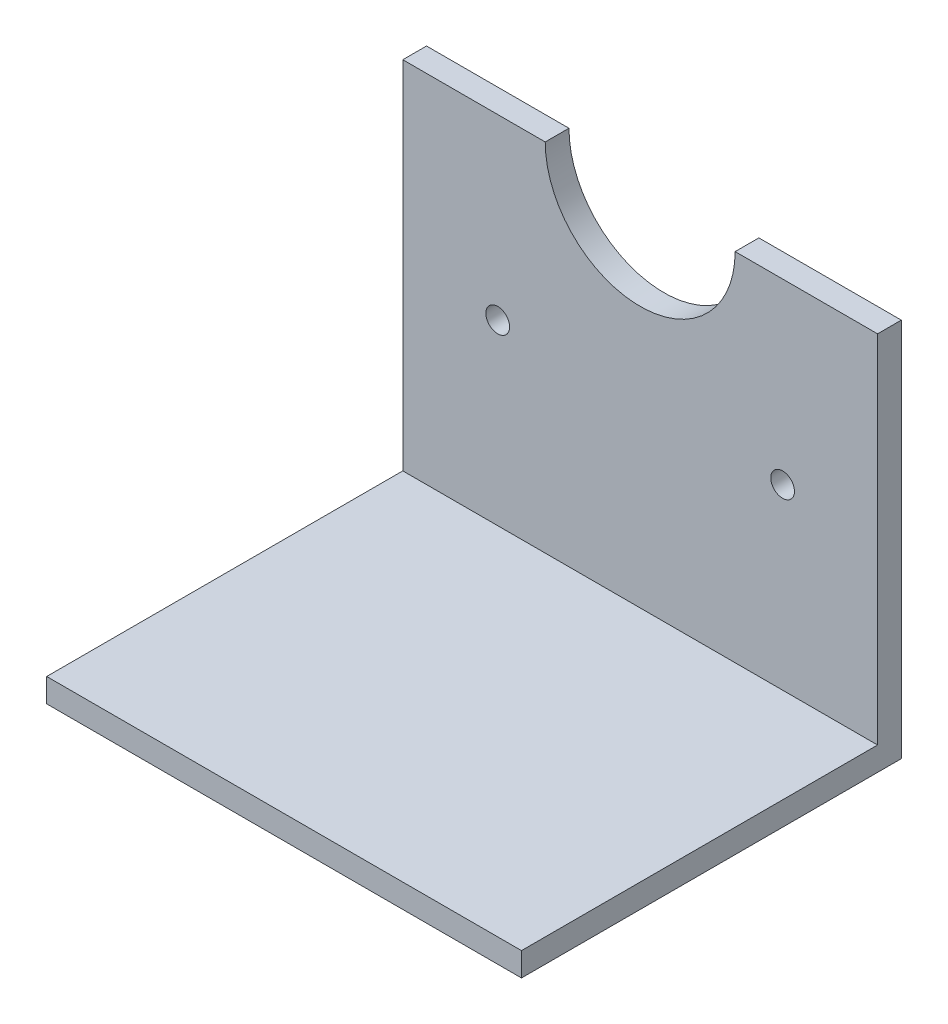
ISO-10303-21;
HEADER;
FILE_DESCRIPTION(('STEP AP214'),'2;1');
FILE_NAME('part.step','',(''),(''),'','','');
FILE_SCHEMA(('AUTOMOTIVE_DESIGN { 1 0 10303 214 1 1 1 1 }'));
ENDSEC;
DATA;
#1=APPLICATION_CONTEXT('core data for automotive mechanical design processes');
#2=APPLICATION_PROTOCOL_DEFINITION('international standard','automotive_design',2000,#1);
#3=PRODUCT_CONTEXT('',#1,'mechanical');
#4=PRODUCT('Part','Part','',(#3));
#5=PRODUCT_RELATED_PRODUCT_CATEGORY('part','',(#4));
#6=PRODUCT_DEFINITION_FORMATION('','',#4);
#7=PRODUCT_DEFINITION_CONTEXT('part definition',#1,'design');
#8=PRODUCT_DEFINITION('design','',#6,#7);
#9=PRODUCT_DEFINITION_SHAPE('','',#8);
#10=(LENGTH_UNIT() NAMED_UNIT(*) SI_UNIT(.MILLI.,.METRE.));
#11=(NAMED_UNIT(*) PLANE_ANGLE_UNIT() SI_UNIT($,.RADIAN.));
#12=(NAMED_UNIT(*) SI_UNIT($,.STERADIAN.) SOLID_ANGLE_UNIT());
#13=UNCERTAINTY_MEASURE_WITH_UNIT(LENGTH_MEASURE(1.E-05),#10,'distance_accuracy_value','');
#14=(GEOMETRIC_REPRESENTATION_CONTEXT(3) GLOBAL_UNCERTAINTY_ASSIGNED_CONTEXT((#13)) GLOBAL_UNIT_ASSIGNED_CONTEXT((#10,
#11,#12)) REPRESENTATION_CONTEXT('',''));
#15=CARTESIAN_POINT('',(0.,0.,0.));
#16=DIRECTION('',(0.,0.,1.));
#17=DIRECTION('',(1.,0.,0.));
#18=AXIS2_PLACEMENT_3D('',#15,#16,#17);
#19=CARTESIAN_POINT('',(63.5,47.625,0.));
#20=DIRECTION('',(0.,-1.,0.));
#21=DIRECTION('',(0.,0.,-1.));
#22=AXIS2_PLACEMENT_3D('',#19,#20,#21);
#23=PLANE('',#22);
#24=DIRECTION('',(-1.,0.,0.));
#25=VECTOR('',#24,1.);
#26=CARTESIAN_POINT('',(63.5,47.625,0.));
#27=LINE('',#26,#25);
#28=CARTESIAN_POINT('',(63.5,47.625,0.));
#29=VERTEX_POINT('',#28);
#30=CARTESIAN_POINT('',(44.45,47.625,0.));
#31=VERTEX_POINT('',#30);
#32=EDGE_CURVE('E11',#29,#31,#27,.T.);
#33=ORIENTED_EDGE('',*,*,#32,.T.);
#34=DIRECTION('',(0.,0.,1.));
#35=VECTOR('',#34,1.);
#36=CARTESIAN_POINT('',(44.45,47.625,-35.9210244842766));
#37=LINE('',#36,#35);
#38=CARTESIAN_POINT('',(44.45,47.625,3.175));
#39=VERTEX_POINT('',#38);
#40=EDGE_CURVE('E47',#31,#39,#37,.T.);
#41=ORIENTED_EDGE('',*,*,#40,.T.);
#42=DIRECTION('',(-1.,0.,0.));
#43=VECTOR('',#42,1.);
#44=CARTESIAN_POINT('',(63.5,47.625,3.175));
#45=LINE('',#44,#43);
#46=CARTESIAN_POINT('',(63.5,47.625,3.175));
#47=VERTEX_POINT('',#46);
#48=EDGE_CURVE('E147',#47,#39,#45,.T.);
#49=ORIENTED_EDGE('',*,*,#48,.F.);
#50=DIRECTION('',(0.,0.,1.));
#51=VECTOR('',#50,1.);
#52=CARTESIAN_POINT('',(63.5,47.625,0.));
#53=LINE('',#52,#51);
#54=EDGE_CURVE('E92',#29,#47,#53,.T.);
#55=ORIENTED_EDGE('',*,*,#54,.F.);
#56=EDGE_LOOP('',(#33,#41,#49,#55));
#57=FACE_BOUND('',#56,.T.);
#58=ADVANCED_FACE('F32',(#57),#23,.F.);
#59=CARTESIAN_POINT('',(19.05,47.625,3.175));
#60=VERTEX_POINT('',#59);
#61=CARTESIAN_POINT('',(0.,47.625,3.175));
#62=VERTEX_POINT('',#61);
#63=EDGE_CURVE('E146',#60,#62,#45,.T.);
#64=ORIENTED_EDGE('',*,*,#63,.F.);
#65=DIRECTION('',(0.,0.,1.));
#66=VECTOR('',#65,1.);
#67=CARTESIAN_POINT('',(19.05,47.625,-35.9210244842766));
#68=LINE('',#67,#66);
#69=CARTESIAN_POINT('',(19.05,47.625,0.));
#70=VERTEX_POINT('',#69);
#71=EDGE_CURVE('E168',#60,#70,#68,.F.);
#72=ORIENTED_EDGE('',*,*,#71,.T.);
#73=CARTESIAN_POINT('',(0.,47.625,0.));
#74=VERTEX_POINT('',#73);
#75=EDGE_CURVE('E40',#70,#74,#27,.T.);
#76=ORIENTED_EDGE('',*,*,#75,.T.);
#77=DIRECTION('',(0.,0.,1.));
#78=VECTOR('',#77,1.);
#79=CARTESIAN_POINT('',(0.,47.625,0.));
#80=LINE('',#79,#78);
#81=EDGE_CURVE('E132',#74,#62,#80,.T.);
#82=ORIENTED_EDGE('',*,*,#81,.T.);
#83=EDGE_LOOP('',(#64,#72,#76,#82));
#84=FACE_BOUND('',#83,.T.);
#85=ADVANCED_FACE('F34',(#84),#23,.F.);
#86=CARTESIAN_POINT('',(63.5,0.,3.175));
#87=DIRECTION('',(0.,0.,-1.));
#88=DIRECTION('',(-1.,0.,0.));
#89=AXIS2_PLACEMENT_3D('',#86,#87,#88);
#90=PLANE('',#89);
#91=CARTESIAN_POINT('',(12.7,23.8125,3.175));
#92=DIRECTION('',(0.,0.,1.));
#93=DIRECTION('',(1.,0.,0.));
#94=AXIS2_PLACEMENT_3D('',#91,#92,#93);
#95=CIRCLE('',#94,1.58749999999998);
#96=CARTESIAN_POINT('',(14.2875,23.8125,3.175));
#97=VERTEX_POINT('',#96);
#98=EDGE_CURVE('E176',#97,#97,#95,.T.);
#99=ORIENTED_EDGE('',*,*,#98,.F.);
#100=EDGE_LOOP('',(#99));
#101=FACE_BOUND('',#100,.T.);
#102=CARTESIAN_POINT('',(50.8,23.8125,3.175));
#103=DIRECTION('',(0.,0.,1.));
#104=DIRECTION('',(1.,0.,0.));
#105=AXIS2_PLACEMENT_3D('',#102,#103,#104);
#106=CIRCLE('',#105,1.58749999999998);
#107=CARTESIAN_POINT('',(52.3875,23.8125,3.175));
#108=VERTEX_POINT('',#107);
#109=EDGE_CURVE('E177',#108,#108,#106,.T.);
#110=ORIENTED_EDGE('',*,*,#109,.F.);
#111=EDGE_LOOP('',(#110));
#112=FACE_BOUND('',#111,.T.);
#113=ORIENTED_EDGE('',*,*,#48,.T.);
#114=CARTESIAN_POINT('',(31.75,47.625,3.175));
#115=DIRECTION('',(0.,0.,1.));
#116=DIRECTION('',(1.,0.,0.));
#117=AXIS2_PLACEMENT_3D('',#114,#115,#116);
#118=CIRCLE('',#117,12.7);
#119=EDGE_CURVE('E155',#60,#39,#118,.T.);
#120=ORIENTED_EDGE('',*,*,#119,.F.);
#121=ORIENTED_EDGE('',*,*,#63,.T.);
#122=DIRECTION('',(0.,-1.,0.));
#123=VECTOR('',#122,1.);
#124=CARTESIAN_POINT('',(0.,0.,3.175));
#125=LINE('',#124,#123);
#126=CARTESIAN_POINT('',(0.,0.,3.175));
#127=VERTEX_POINT('',#126);
#128=EDGE_CURVE('E135',#62,#127,#125,.T.);
#129=ORIENTED_EDGE('',*,*,#128,.T.);
#130=DIRECTION('',(-1.,0.,0.));
#131=VECTOR('',#130,1.);
#132=CARTESIAN_POINT('',(63.5,0.,3.175));
#133=LINE('',#132,#131);
#134=CARTESIAN_POINT('',(63.5,0.,3.175));
#135=VERTEX_POINT('',#134);
#136=EDGE_CURVE('E121',#135,#127,#133,.T.);
#137=ORIENTED_EDGE('',*,*,#136,.F.);
#138=DIRECTION('',(0.,-1.,0.));
#139=VECTOR('',#138,1.);
#140=CARTESIAN_POINT('',(63.5,0.,3.175));
#141=LINE('',#140,#139);
#142=EDGE_CURVE('E109',#47,#135,#141,.T.);
#143=ORIENTED_EDGE('',*,*,#142,.F.);
#144=EDGE_LOOP('',(#113,#120,#121,#129,#137,#143));
#145=FACE_BOUND('',#144,.T.);
#146=ADVANCED_FACE('F153',(#101,#112,#145),#90,.F.);
#147=CARTESIAN_POINT('',(63.5,0.,3.175));
#148=DIRECTION('',(0.,-1.,0.));
#149=DIRECTION('',(0.,0.,-1.));
#150=AXIS2_PLACEMENT_3D('',#147,#148,#149);
#151=PLANE('',#150);
#152=DIRECTION('',(0.,0.,1.));
#153=VECTOR('',#152,1.);
#154=CARTESIAN_POINT('',(0.,0.,3.175));
#155=LINE('',#154,#153);
#156=CARTESIAN_POINT('',(0.,0.,50.8));
#157=VERTEX_POINT('',#156);
#158=EDGE_CURVE('E118',#127,#157,#155,.T.);
#159=ORIENTED_EDGE('',*,*,#158,.T.);
#160=DIRECTION('',(-1.,0.,0.));
#161=VECTOR('',#160,1.);
#162=CARTESIAN_POINT('',(63.5,0.,50.8));
#163=LINE('',#162,#161);
#164=CARTESIAN_POINT('',(63.5,0.,50.8));
#165=VERTEX_POINT('',#164);
#166=EDGE_CURVE('E115',#165,#157,#163,.T.);
#167=ORIENTED_EDGE('',*,*,#166,.F.);
#168=DIRECTION('',(0.,0.,1.));
#169=VECTOR('',#168,1.);
#170=CARTESIAN_POINT('',(63.5,0.,3.175));
#171=LINE('',#170,#169);
#172=EDGE_CURVE('E102',#135,#165,#171,.T.);
#173=ORIENTED_EDGE('',*,*,#172,.F.);
#174=ORIENTED_EDGE('',*,*,#136,.T.);
#175=EDGE_LOOP('',(#159,#167,#173,#174));
#176=FACE_BOUND('',#175,.T.);
#177=ADVANCED_FACE('F116',(#176),#151,.F.);
#178=CARTESIAN_POINT('',(63.5,0.,50.8));
#179=DIRECTION('',(0.,0.,-1.));
#180=DIRECTION('',(-1.,0.,0.));
#181=AXIS2_PLACEMENT_3D('',#178,#179,#180);
#182=PLANE('',#181);
#183=DIRECTION('',(0.,-1.,0.));
#184=VECTOR('',#183,1.);
#185=CARTESIAN_POINT('',(0.,0.,50.8));
#186=LINE('',#185,#184);
#187=CARTESIAN_POINT('',(0.,-3.175,50.8));
#188=VERTEX_POINT('',#187);
#189=EDGE_CURVE('E138',#157,#188,#186,.T.);
#190=ORIENTED_EDGE('',*,*,#189,.T.);
#191=DIRECTION('',(-1.,0.,0.));
#192=VECTOR('',#191,1.);
#193=CARTESIAN_POINT('',(63.5,-3.175,50.8));
#194=LINE('',#193,#192);
#195=CARTESIAN_POINT('',(63.5,-3.175,50.8));
#196=VERTEX_POINT('',#195);
#197=EDGE_CURVE('E122',#196,#188,#194,.T.);
#198=ORIENTED_EDGE('',*,*,#197,.F.);
#199=DIRECTION('',(0.,-1.,0.));
#200=VECTOR('',#199,1.);
#201=CARTESIAN_POINT('',(63.5,0.,50.8));
#202=LINE('',#201,#200);
#203=EDGE_CURVE('E106',#165,#196,#202,.T.);
#204=ORIENTED_EDGE('',*,*,#203,.F.);
#205=ORIENTED_EDGE('',*,*,#166,.T.);
#206=EDGE_LOOP('',(#190,#198,#204,#205));
#207=FACE_BOUND('',#206,.T.);
#208=ADVANCED_FACE('F124',(#207),#182,.F.);
#209=CARTESIAN_POINT('',(63.5,-3.175,0.));
#210=DIRECTION('',(0.,1.,0.));
#211=DIRECTION('',(0.,0.,1.));
#212=AXIS2_PLACEMENT_3D('',#209,#210,#211);
#213=PLANE('',#212);
#214=DIRECTION('',(0.,0.,-1.));
#215=VECTOR('',#214,1.);
#216=CARTESIAN_POINT('',(0.,-3.175,0.));
#217=LINE('',#216,#215);
#218=CARTESIAN_POINT('',(0.,-3.175,0.));
#219=VERTEX_POINT('',#218);
#220=EDGE_CURVE('E85',#188,#219,#217,.T.);
#221=ORIENTED_EDGE('',*,*,#220,.T.);
#222=DIRECTION('',(-1.,0.,0.));
#223=VECTOR('',#222,1.);
#224=CARTESIAN_POINT('',(63.5,-3.175,0.));
#225=LINE('',#224,#223);
#226=CARTESIAN_POINT('',(63.5,-3.175,0.));
#227=VERTEX_POINT('',#226);
#228=EDGE_CURVE('E128',#227,#219,#225,.T.);
#229=ORIENTED_EDGE('',*,*,#228,.F.);
#230=DIRECTION('',(0.,0.,-1.));
#231=VECTOR('',#230,1.);
#232=CARTESIAN_POINT('',(63.5,-3.175,0.));
#233=LINE('',#232,#231);
#234=EDGE_CURVE('E126',#196,#227,#233,.T.);
#235=ORIENTED_EDGE('',*,*,#234,.F.);
#236=ORIENTED_EDGE('',*,*,#197,.T.);
#237=EDGE_LOOP('',(#221,#229,#235,#236));
#238=FACE_BOUND('',#237,.T.);
#239=ADVANCED_FACE('F163',(#238),#213,.F.);
#240=CARTESIAN_POINT('',(63.5,0.,0.));
#241=DIRECTION('',(0.,0.,1.));
#242=DIRECTION('',(1.,0.,0.));
#243=AXIS2_PLACEMENT_3D('',#240,#241,#242);
#244=PLANE('',#243);
#245=CARTESIAN_POINT('',(12.7,23.8125,0.));
#246=DIRECTION('',(0.,0.,1.));
#247=DIRECTION('',(1.,0.,0.));
#248=AXIS2_PLACEMENT_3D('',#245,#246,#247);
#249=CIRCLE('',#248,1.58749999999998);
#250=CARTESIAN_POINT('',(14.2875,23.8125,0.));
#251=VERTEX_POINT('',#250);
#252=EDGE_CURVE('E180',#251,#251,#249,.F.);
#253=ORIENTED_EDGE('',*,*,#252,.F.);
#254=EDGE_LOOP('',(#253));
#255=FACE_BOUND('',#254,.T.);
#256=CARTESIAN_POINT('',(50.8,23.8125,0.));
#257=DIRECTION('',(0.,0.,1.));
#258=DIRECTION('',(1.,0.,0.));
#259=AXIS2_PLACEMENT_3D('',#256,#257,#258);
#260=CIRCLE('',#259,1.58749999999998);
#261=CARTESIAN_POINT('',(52.3875,23.8125,0.));
#262=VERTEX_POINT('',#261);
#263=EDGE_CURVE('E173',#262,#262,#260,.F.);
#264=ORIENTED_EDGE('',*,*,#263,.F.);
#265=EDGE_LOOP('',(#264));
#266=FACE_BOUND('',#265,.T.);
#267=ORIENTED_EDGE('',*,*,#75,.F.);
#268=CARTESIAN_POINT('',(31.75,47.625,0.));
#269=DIRECTION('',(0.,0.,1.));
#270=DIRECTION('',(1.,0.,0.));
#271=AXIS2_PLACEMENT_3D('',#268,#269,#270);
#272=CIRCLE('',#271,12.7);
#273=EDGE_CURVE('E166',#31,#70,#272,.F.);
#274=ORIENTED_EDGE('',*,*,#273,.F.);
#275=ORIENTED_EDGE('',*,*,#32,.F.);
#276=DIRECTION('',(0.,1.,0.));
#277=VECTOR('',#276,1.);
#278=CARTESIAN_POINT('',(63.5,0.,0.));
#279=LINE('',#278,#277);
#280=EDGE_CURVE('E56',#227,#29,#279,.T.);
#281=ORIENTED_EDGE('',*,*,#280,.F.);
#282=ORIENTED_EDGE('',*,*,#228,.T.);
#283=DIRECTION('',(0.,1.,0.));
#284=VECTOR('',#283,1.);
#285=CARTESIAN_POINT('',(0.,0.,0.));
#286=LINE('',#285,#284);
#287=EDGE_CURVE('E141',#219,#74,#286,.T.);
#288=ORIENTED_EDGE('',*,*,#287,.T.);
#289=EDGE_LOOP('',(#267,#274,#275,#281,#282,#288));
#290=FACE_BOUND('',#289,.T.);
#291=ADVANCED_FACE('F165',(#255,#266,#290),#244,.F.);
#292=CARTESIAN_POINT('',(63.5,0.,0.));
#293=DIRECTION('',(1.,0.,0.));
#294=DIRECTION('',(0.,0.,-1.));
#295=AXIS2_PLACEMENT_3D('',#292,#293,#294);
#296=PLANE('',#295);
#297=ORIENTED_EDGE('',*,*,#280,.T.);
#298=ORIENTED_EDGE('',*,*,#54,.T.);
#299=ORIENTED_EDGE('',*,*,#142,.T.);
#300=ORIENTED_EDGE('',*,*,#172,.T.);
#301=ORIENTED_EDGE('',*,*,#203,.T.);
#302=ORIENTED_EDGE('',*,*,#234,.T.);
#303=EDGE_LOOP('',(#297,#298,#299,#300,#301,#302));
#304=FACE_BOUND('',#303,.T.);
#305=ADVANCED_FACE('F104',(#304),#296,.T.);
#306=CARTESIAN_POINT('',(0.,0.,0.));
#307=DIRECTION('',(1.,0.,0.));
#308=DIRECTION('',(0.,0.,-1.));
#309=AXIS2_PLACEMENT_3D('',#306,#307,#308);
#310=PLANE('',#309);
#311=ORIENTED_EDGE('',*,*,#81,.F.);
#312=ORIENTED_EDGE('',*,*,#287,.F.);
#313=ORIENTED_EDGE('',*,*,#220,.F.);
#314=ORIENTED_EDGE('',*,*,#189,.F.);
#315=ORIENTED_EDGE('',*,*,#158,.F.);
#316=ORIENTED_EDGE('',*,*,#128,.F.);
#317=EDGE_LOOP('',(#311,#312,#313,#314,#315,#316));
#318=FACE_BOUND('',#317,.T.);
#319=ADVANCED_FACE('F162',(#318),#310,.F.);
#320=CARTESIAN_POINT('',(50.8,23.8125,-35.9210244842766));
#321=DIRECTION('',(0.,0.,1.));
#322=DIRECTION('',(1.,0.,0.));
#323=AXIS2_PLACEMENT_3D('',#320,#321,#322);
#324=CYLINDRICAL_SURFACE('',#323,1.58749999999998);
#325=ORIENTED_EDGE('',*,*,#263,.T.);
#326=EDGE_LOOP('',(#325));
#327=FACE_BOUND('',#326,.T.);
#328=ORIENTED_EDGE('',*,*,#109,.T.);
#329=EDGE_LOOP('',(#328));
#330=FACE_BOUND('',#329,.T.);
#331=ADVANCED_FACE('F195',(#327,#330),#324,.F.);
#332=CARTESIAN_POINT('',(12.7,23.8125,-35.9210244842766));
#333=DIRECTION('',(0.,0.,1.));
#334=DIRECTION('',(1.,0.,0.));
#335=AXIS2_PLACEMENT_3D('',#332,#333,#334);
#336=CYLINDRICAL_SURFACE('',#335,1.58749999999998);
#337=ORIENTED_EDGE('',*,*,#252,.T.);
#338=EDGE_LOOP('',(#337));
#339=FACE_BOUND('',#338,.T.);
#340=ORIENTED_EDGE('',*,*,#98,.T.);
#341=EDGE_LOOP('',(#340));
#342=FACE_BOUND('',#341,.T.);
#343=ADVANCED_FACE('F190',(#339,#342),#336,.F.);
#344=CARTESIAN_POINT('',(31.75,47.625,-35.9210244842766));
#345=DIRECTION('',(0.,0.,1.));
#346=DIRECTION('',(1.,0.,0.));
#347=AXIS2_PLACEMENT_3D('',#344,#345,#346);
#348=CYLINDRICAL_SURFACE('',#347,12.7);
#349=ORIENTED_EDGE('',*,*,#273,.T.);
#350=ORIENTED_EDGE('',*,*,#71,.F.);
#351=ORIENTED_EDGE('',*,*,#119,.T.);
#352=ORIENTED_EDGE('',*,*,#40,.F.);
#353=EDGE_LOOP('',(#349,#350,#351,#352));
#354=FACE_BOUND('',#353,.T.);
#355=ADVANCED_FACE('F187',(#354),#348,.F.);
#356=CLOSED_SHELL('',(#58,#85,#146,#177,#208,#239,#291,#305,#319,#331,#343,#355));
#357=MANIFOLD_SOLID_BREP('B2',#356);
#358=ADVANCED_BREP_SHAPE_REPRESENTATION('',(#18,#357),#14);
#359=SHAPE_DEFINITION_REPRESENTATION(#9,#358);
ENDSEC;
END-ISO-10303-21;
